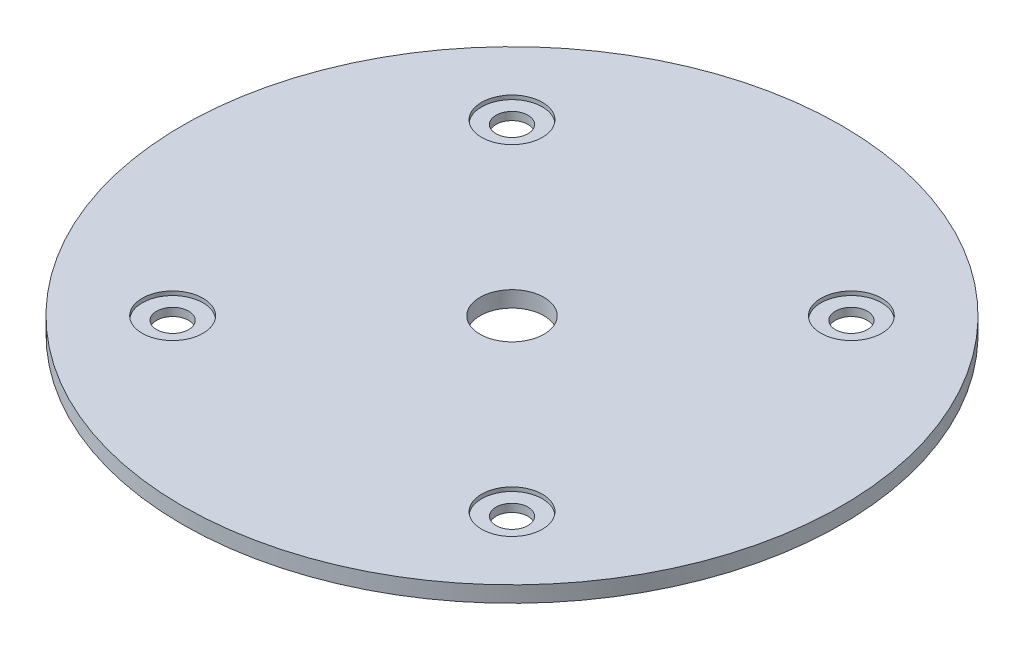
ISO-10303-21;
HEADER;
FILE_DESCRIPTION(('STEP AP214'),'2;1');
FILE_NAME('part.step','',(''),(''),'','','');
FILE_SCHEMA(('AUTOMOTIVE_DESIGN { 1 0 10303 214 1 1 1 1 }'));
ENDSEC;
DATA;
#1=APPLICATION_CONTEXT('core data for automotive mechanical design processes');
#2=APPLICATION_PROTOCOL_DEFINITION('international standard','automotive_design',2000,#1);
#3=PRODUCT_CONTEXT('',#1,'mechanical');
#4=PRODUCT('Part','Part','',(#3));
#5=PRODUCT_RELATED_PRODUCT_CATEGORY('part','',(#4));
#6=PRODUCT_DEFINITION_FORMATION('','',#4);
#7=PRODUCT_DEFINITION_CONTEXT('part definition',#1,'design');
#8=PRODUCT_DEFINITION('design','',#6,#7);
#9=PRODUCT_DEFINITION_SHAPE('','',#8);
#10=(LENGTH_UNIT() NAMED_UNIT(*) SI_UNIT(.MILLI.,.METRE.));
#11=(NAMED_UNIT(*) PLANE_ANGLE_UNIT() SI_UNIT($,.RADIAN.));
#12=(NAMED_UNIT(*) SI_UNIT($,.STERADIAN.) SOLID_ANGLE_UNIT());
#13=UNCERTAINTY_MEASURE_WITH_UNIT(LENGTH_MEASURE(1.E-05),#10,'distance_accuracy_value','');
#14=(GEOMETRIC_REPRESENTATION_CONTEXT(3) GLOBAL_UNCERTAINTY_ASSIGNED_CONTEXT((#13)) GLOBAL_UNIT_ASSIGNED_CONTEXT((#10,
#11,#12)) REPRESENTATION_CONTEXT('',''));
#15=CARTESIAN_POINT('',(0.,0.,0.));
#16=DIRECTION('',(0.,0.,1.));
#17=DIRECTION('',(1.,0.,0.));
#18=AXIS2_PLACEMENT_3D('',#15,#16,#17);
#19=CARTESIAN_POINT('',(-33.6759604540092,1.5875,33.6759604540094));
#20=DIRECTION('',(0.,1.,0.));
#21=DIRECTION('',(0.,0.,1.));
#22=AXIS2_PLACEMENT_3D('',#19,#20,#21);
#23=CYLINDRICAL_SURFACE('',#22,3.175);
#24=CARTESIAN_POINT('',(-33.6759604540092,0.79375,33.6759604540094));
#25=DIRECTION('',(0.,1.,0.));
#26=DIRECTION('',(0.,0.,1.));
#27=AXIS2_PLACEMENT_3D('',#24,#25,#26);
#28=CIRCLE('',#27,3.175);
#29=CARTESIAN_POINT('',(-33.6759604540092,0.79375,36.8509604540094));
#30=VERTEX_POINT('',#29);
#31=EDGE_CURVE('E65',#30,#30,#28,.F.);
#32=ORIENTED_EDGE('',*,*,#31,.F.);
#33=EDGE_LOOP('',(#32));
#34=FACE_BOUND('',#33,.T.);
#35=CARTESIAN_POINT('',(-33.6759604540092,-0.79375,33.6759604540094));
#36=DIRECTION('',(0.,-1.,0.));
#37=DIRECTION('',(0.,0.,-1.));
#38=AXIS2_PLACEMENT_3D('',#35,#36,#37);
#39=CIRCLE('',#38,3.175);
#40=CARTESIAN_POINT('',(-33.6759604540092,-0.79375,30.5009604540094));
#41=VERTEX_POINT('',#40);
#42=EDGE_CURVE('E41',#41,#41,#39,.F.);
#43=ORIENTED_EDGE('',*,*,#42,.F.);
#44=EDGE_LOOP('',(#43));
#45=FACE_BOUND('',#44,.T.);
#46=ADVANCED_FACE('F37',(#34,#45),#23,.F.);
#47=CARTESIAN_POINT('',(33.6759604540094,1.5875,33.6759604540092));
#48=DIRECTION('',(0.,1.,0.));
#49=DIRECTION('',(0.,0.,1.));
#50=AXIS2_PLACEMENT_3D('',#47,#48,#49);
#51=CYLINDRICAL_SURFACE('',#50,3.175);
#52=CARTESIAN_POINT('',(33.6759604540094,0.79375,33.6759604540092));
#53=DIRECTION('',(0.,1.,0.));
#54=DIRECTION('',(0.,0.,1.));
#55=AXIS2_PLACEMENT_3D('',#52,#53,#54);
#56=CIRCLE('',#55,3.175);
#57=CARTESIAN_POINT('',(33.6759604540094,0.79375,36.8509604540092));
#58=VERTEX_POINT('',#57);
#59=EDGE_CURVE('E62',#58,#58,#56,.F.);
#60=ORIENTED_EDGE('',*,*,#59,.F.);
#61=EDGE_LOOP('',(#60));
#62=FACE_BOUND('',#61,.T.);
#63=CARTESIAN_POINT('',(33.6759604540094,-0.79375,33.6759604540092));
#64=DIRECTION('',(0.,-1.,0.));
#65=DIRECTION('',(0.,0.,-1.));
#66=AXIS2_PLACEMENT_3D('',#63,#64,#65);
#67=CIRCLE('',#66,3.175);
#68=CARTESIAN_POINT('',(33.6759604540094,-0.79375,30.5009604540093));
#69=VERTEX_POINT('',#68);
#70=EDGE_CURVE('E75',#69,#69,#67,.F.);
#71=ORIENTED_EDGE('',*,*,#70,.F.);
#72=EDGE_LOOP('',(#71));
#73=FACE_BOUND('',#72,.T.);
#74=ADVANCED_FACE('F125',(#62,#73),#51,.F.);
#75=CARTESIAN_POINT('',(33.6759604540092,1.5875,-33.6759604540094));
#76=DIRECTION('',(0.,1.,0.));
#77=DIRECTION('',(0.,0.,1.));
#78=AXIS2_PLACEMENT_3D('',#75,#76,#77);
#79=CYLINDRICAL_SURFACE('',#78,3.175);
#80=CARTESIAN_POINT('',(33.6759604540092,0.79375,-33.6759604540094));
#81=DIRECTION('',(0.,1.,0.));
#82=DIRECTION('',(0.,0.,1.));
#83=AXIS2_PLACEMENT_3D('',#80,#81,#82);
#84=CIRCLE('',#83,3.175);
#85=CARTESIAN_POINT('',(33.6759604540092,0.79375,-30.5009604540094));
#86=VERTEX_POINT('',#85);
#87=EDGE_CURVE('E58',#86,#86,#84,.F.);
#88=ORIENTED_EDGE('',*,*,#87,.F.);
#89=EDGE_LOOP('',(#88));
#90=FACE_BOUND('',#89,.T.);
#91=CARTESIAN_POINT('',(33.6759604540092,-0.79375,-33.6759604540094));
#92=DIRECTION('',(0.,-1.,0.));
#93=DIRECTION('',(0.,0.,-1.));
#94=AXIS2_PLACEMENT_3D('',#91,#92,#93);
#95=CIRCLE('',#94,3.175);
#96=CARTESIAN_POINT('',(33.6759604540092,-0.79375,-36.8509604540094));
#97=VERTEX_POINT('',#96);
#98=EDGE_CURVE('E72',#97,#97,#95,.F.);
#99=ORIENTED_EDGE('',*,*,#98,.F.);
#100=EDGE_LOOP('',(#99));
#101=FACE_BOUND('',#100,.T.);
#102=ADVANCED_FACE('F132',(#90,#101),#79,.F.);
#103=CARTESIAN_POINT('',(-33.6759604540094,1.5875,-33.6759604540092));
#104=DIRECTION('',(0.,1.,0.));
#105=DIRECTION('',(0.,0.,1.));
#106=AXIS2_PLACEMENT_3D('',#103,#104,#105);
#107=CYLINDRICAL_SURFACE('',#106,3.175);
#108=CARTESIAN_POINT('',(-33.6759604540094,0.79375,-33.6759604540092));
#109=DIRECTION('',(0.,1.,0.));
#110=DIRECTION('',(0.,0.,1.));
#111=AXIS2_PLACEMENT_3D('',#108,#109,#110);
#112=CIRCLE('',#111,3.175);
#113=CARTESIAN_POINT('',(-33.6759604540094,0.79375,-30.5009604540093));
#114=VERTEX_POINT('',#113);
#115=EDGE_CURVE('E55',#114,#114,#112,.F.);
#116=ORIENTED_EDGE('',*,*,#115,.F.);
#117=EDGE_LOOP('',(#116));
#118=FACE_BOUND('',#117,.T.);
#119=CARTESIAN_POINT('',(-33.6759604540094,-0.79375,-33.6759604540092));
#120=DIRECTION('',(0.,-1.,0.));
#121=DIRECTION('',(0.,0.,-1.));
#122=AXIS2_PLACEMENT_3D('',#119,#120,#121);
#123=CIRCLE('',#122,3.175);
#124=CARTESIAN_POINT('',(-33.6759604540094,-0.79375,-36.8509604540092));
#125=VERTEX_POINT('',#124);
#126=EDGE_CURVE('E69',#125,#125,#123,.F.);
#127=ORIENTED_EDGE('',*,*,#126,.F.);
#128=EDGE_LOOP('',(#127));
#129=FACE_BOUND('',#128,.T.);
#130=ADVANCED_FACE('F142',(#118,#129),#107,.F.);
#131=CARTESIAN_POINT('',(0.,1.5875,0.));
#132=DIRECTION('',(0.,-1.,0.));
#133=DIRECTION('',(0.,0.,-1.));
#134=AXIS2_PLACEMENT_3D('',#131,#132,#133);
#135=CYLINDRICAL_SURFACE('',#134,65.405);
#136=CARTESIAN_POINT('',(0.,1.5875,0.));
#137=DIRECTION('',(0.,1.,0.));
#138=DIRECTION('',(0.,0.,1.));
#139=AXIS2_PLACEMENT_3D('',#136,#137,#138);
#140=CIRCLE('',#139,65.405);
#141=CARTESIAN_POINT('',(0.,1.5875,65.405));
#142=VERTEX_POINT('',#141);
#143=EDGE_CURVE('E10',#142,#142,#140,.T.);
#144=ORIENTED_EDGE('',*,*,#143,.F.);
#145=EDGE_LOOP('',(#144));
#146=FACE_BOUND('',#145,.T.);
#147=CARTESIAN_POINT('',(0.,-1.5875,0.));
#148=DIRECTION('',(0.,1.,0.));
#149=DIRECTION('',(0.,0.,1.));
#150=AXIS2_PLACEMENT_3D('',#147,#148,#149);
#151=CIRCLE('',#150,65.405);
#152=CARTESIAN_POINT('',(0.,-1.5875,65.405));
#153=VERTEX_POINT('',#152);
#154=EDGE_CURVE('E45',#153,#153,#151,.T.);
#155=ORIENTED_EDGE('',*,*,#154,.T.);
#156=EDGE_LOOP('',(#155));
#157=FACE_BOUND('',#156,.T.);
#158=ADVANCED_FACE('F39',(#146,#157),#135,.T.);
#159=CARTESIAN_POINT('',(0.,1.5875,0.));
#160=DIRECTION('',(0.,1.,0.));
#161=DIRECTION('',(0.,0.,1.));
#162=AXIS2_PLACEMENT_3D('',#159,#160,#161);
#163=PLANE('',#162);
#164=CARTESIAN_POINT('',(-33.6759604540092,1.5875,33.6759604540094));
#165=DIRECTION('',(0.,1.,0.));
#166=DIRECTION('',(0.,0.,1.));
#167=AXIS2_PLACEMENT_3D('',#164,#165,#166);
#168=CIRCLE('',#167,6.0325);
#169=CARTESIAN_POINT('',(-33.6759604540092,1.5875,39.7084604540094));
#170=VERTEX_POINT('',#169);
#171=EDGE_CURVE('E84',#170,#170,#168,.T.);
#172=ORIENTED_EDGE('',*,*,#171,.F.);
#173=EDGE_LOOP('',(#172));
#174=FACE_BOUND('',#173,.T.);
#175=CARTESIAN_POINT('',(33.6759604540094,1.5875,33.6759604540092));
#176=DIRECTION('',(0.,1.,0.));
#177=DIRECTION('',(0.,0.,1.));
#178=AXIS2_PLACEMENT_3D('',#175,#176,#177);
#179=CIRCLE('',#178,6.0325);
#180=CARTESIAN_POINT('',(33.6759604540094,1.5875,39.7084604540093));
#181=VERTEX_POINT('',#180);
#182=EDGE_CURVE('E149',#181,#181,#179,.T.);
#183=ORIENTED_EDGE('',*,*,#182,.F.);
#184=EDGE_LOOP('',(#183));
#185=FACE_BOUND('',#184,.T.);
#186=CARTESIAN_POINT('',(33.6759604540092,1.5875,-33.6759604540094));
#187=DIRECTION('',(0.,1.,0.));
#188=DIRECTION('',(0.,0.,1.));
#189=AXIS2_PLACEMENT_3D('',#186,#187,#188);
#190=CIRCLE('',#189,6.03249999999999);
#191=CARTESIAN_POINT('',(33.6759604540092,1.5875,-27.6434604540094));
#192=VERTEX_POINT('',#191);
#193=EDGE_CURVE('E97',#192,#192,#190,.T.);
#194=ORIENTED_EDGE('',*,*,#193,.F.);
#195=EDGE_LOOP('',(#194));
#196=FACE_BOUND('',#195,.T.);
#197=CARTESIAN_POINT('',(-33.6759604540094,1.5875,-33.6759604540092));
#198=DIRECTION('',(0.,1.,0.));
#199=DIRECTION('',(0.,0.,1.));
#200=AXIS2_PLACEMENT_3D('',#197,#198,#199);
#201=CIRCLE('',#200,6.0325);
#202=CARTESIAN_POINT('',(-33.6759604540094,1.5875,-27.6434604540092));
#203=VERTEX_POINT('',#202);
#204=EDGE_CURVE('E95',#203,#203,#201,.T.);
#205=ORIENTED_EDGE('',*,*,#204,.F.);
#206=EDGE_LOOP('',(#205));
#207=FACE_BOUND('',#206,.T.);
#208=CARTESIAN_POINT('',(0.,1.5875,0.));
#209=DIRECTION('',(0.,1.,0.));
#210=DIRECTION('',(0.,0.,1.));
#211=AXIS2_PLACEMENT_3D('',#208,#209,#210);
#212=CIRCLE('',#211,6.35);
#213=CARTESIAN_POINT('',(0.,1.5875,6.35));
#214=VERTEX_POINT('',#213);
#215=EDGE_CURVE('E68',#214,#214,#212,.T.);
#216=ORIENTED_EDGE('',*,*,#215,.F.);
#217=EDGE_LOOP('',(#216));
#218=FACE_BOUND('',#217,.T.);
#219=ORIENTED_EDGE('',*,*,#143,.T.);
#220=EDGE_LOOP('',(#219));
#221=FACE_BOUND('',#220,.T.);
#222=ADVANCED_FACE('F120',(#174,#185,#196,#207,#218,#221),#163,.T.);
#223=CARTESIAN_POINT('',(0.,-1.5875,0.));
#224=DIRECTION('',(0.,1.,0.));
#225=DIRECTION('',(0.,0.,1.));
#226=AXIS2_PLACEMENT_3D('',#223,#224,#225);
#227=PLANE('',#226);
#228=CARTESIAN_POINT('',(-33.6759604540092,-1.5875,33.6759604540094));
#229=DIRECTION('',(0.,1.,0.));
#230=DIRECTION('',(0.,0.,1.));
#231=AXIS2_PLACEMENT_3D('',#228,#229,#230);
#232=CIRCLE('',#231,6.0325);
#233=CARTESIAN_POINT('',(-33.6759604540092,-1.5875,39.7084604540094));
#234=VERTEX_POINT('',#233);
#235=EDGE_CURVE('E385',#234,#234,#232,.T.);
#236=ORIENTED_EDGE('',*,*,#235,.T.);
#237=EDGE_LOOP('',(#236));
#238=FACE_BOUND('',#237,.T.);
#239=CARTESIAN_POINT('',(33.6759604540094,-1.5875,33.6759604540092));
#240=DIRECTION('',(0.,1.,0.));
#241=DIRECTION('',(0.,0.,1.));
#242=AXIS2_PLACEMENT_3D('',#239,#240,#241);
#243=CIRCLE('',#242,6.0325);
#244=CARTESIAN_POINT('',(33.6759604540094,-1.5875,39.7084604540093));
#245=VERTEX_POINT('',#244);
#246=EDGE_CURVE('E379',#245,#245,#243,.T.);
#247=ORIENTED_EDGE('',*,*,#246,.T.);
#248=EDGE_LOOP('',(#247));
#249=FACE_BOUND('',#248,.T.);
#250=CARTESIAN_POINT('',(33.6759604540092,-1.5875,-33.6759604540094));
#251=DIRECTION('',(0.,1.,0.));
#252=DIRECTION('',(0.,0.,1.));
#253=AXIS2_PLACEMENT_3D('',#250,#251,#252);
#254=CIRCLE('',#253,6.03249999999999);
#255=CARTESIAN_POINT('',(33.6759604540092,-1.5875,-27.6434604540094));
#256=VERTEX_POINT('',#255);
#257=EDGE_CURVE('E369',#256,#256,#254,.T.);
#258=ORIENTED_EDGE('',*,*,#257,.T.);
#259=EDGE_LOOP('',(#258));
#260=FACE_BOUND('',#259,.T.);
#261=CARTESIAN_POINT('',(-33.6759604540094,-1.5875,-33.6759604540092));
#262=DIRECTION('',(0.,1.,0.));
#263=DIRECTION('',(0.,0.,1.));
#264=AXIS2_PLACEMENT_3D('',#261,#262,#263);
#265=CIRCLE('',#264,6.0325);
#266=CARTESIAN_POINT('',(-33.6759604540094,-1.5875,-27.6434604540092));
#267=VERTEX_POINT('',#266);
#268=EDGE_CURVE('E368',#267,#267,#265,.T.);
#269=ORIENTED_EDGE('',*,*,#268,.T.);
#270=EDGE_LOOP('',(#269));
#271=FACE_BOUND('',#270,.T.);
#272=CARTESIAN_POINT('',(0.,-1.5875,0.));
#273=DIRECTION('',(0.,1.,0.));
#274=DIRECTION('',(0.,0.,1.));
#275=AXIS2_PLACEMENT_3D('',#272,#273,#274);
#276=CIRCLE('',#275,6.35);
#277=CARTESIAN_POINT('',(0.,-1.5875,6.35));
#278=VERTEX_POINT('',#277);
#279=EDGE_CURVE('E50',#278,#278,#276,.T.);
#280=ORIENTED_EDGE('',*,*,#279,.T.);
#281=EDGE_LOOP('',(#280));
#282=FACE_BOUND('',#281,.T.);
#283=ORIENTED_EDGE('',*,*,#154,.F.);
#284=EDGE_LOOP('',(#283));
#285=FACE_BOUND('',#284,.T.);
#286=ADVANCED_FACE('F104',(#238,#249,#260,#271,#282,#285),#227,.F.);
#287=CARTESIAN_POINT('',(0.,1.5875,0.));
#288=DIRECTION('',(0.,1.,0.));
#289=DIRECTION('',(0.,0.,1.));
#290=AXIS2_PLACEMENT_3D('',#287,#288,#289);
#291=CYLINDRICAL_SURFACE('',#290,6.35);
#292=ORIENTED_EDGE('',*,*,#279,.F.);
#293=EDGE_LOOP('',(#292));
#294=FACE_BOUND('',#293,.T.);
#295=ORIENTED_EDGE('',*,*,#215,.T.);
#296=EDGE_LOOP('',(#295));
#297=FACE_BOUND('',#296,.T.);
#298=ADVANCED_FACE('F107',(#294,#297),#291,.F.);
#299=CARTESIAN_POINT('',(-33.6759604540094,0.79375,-33.6759604540092));
#300=DIRECTION('',(0.,1.,0.));
#301=DIRECTION('',(0.,0.,1.));
#302=AXIS2_PLACEMENT_3D('',#299,#300,#301);
#303=PLANE('',#302);
#304=CARTESIAN_POINT('',(-33.6759604540094,0.79375,-33.6759604540092));
#305=DIRECTION('',(0.,1.,0.));
#306=DIRECTION('',(0.,0.,1.));
#307=AXIS2_PLACEMENT_3D('',#304,#305,#306);
#308=CIRCLE('',#307,6.0325);
#309=CARTESIAN_POINT('',(-33.6759604540094,0.79375,-27.6434604540092));
#310=VERTEX_POINT('',#309);
#311=EDGE_CURVE('E59',#310,#310,#308,.T.);
#312=ORIENTED_EDGE('',*,*,#311,.T.);
#313=EDGE_LOOP('',(#312));
#314=FACE_BOUND('',#313,.T.);
#315=ORIENTED_EDGE('',*,*,#115,.T.);
#316=EDGE_LOOP('',(#315));
#317=FACE_BOUND('',#316,.T.);
#318=ADVANCED_FACE('F109',(#314,#317),#303,.T.);
#319=CARTESIAN_POINT('',(-33.6759604540094,0.79375,-33.6759604540092));
#320=DIRECTION('',(0.,1.,0.));
#321=DIRECTION('',(0.,0.,1.));
#322=AXIS2_PLACEMENT_3D('',#319,#320,#321);
#323=CYLINDRICAL_SURFACE('',#322,6.0325);
#324=ORIENTED_EDGE('',*,*,#311,.F.);
#325=EDGE_LOOP('',(#324));
#326=FACE_BOUND('',#325,.T.);
#327=ORIENTED_EDGE('',*,*,#204,.T.);
#328=EDGE_LOOP('',(#327));
#329=FACE_BOUND('',#328,.T.);
#330=ADVANCED_FACE('F116',(#326,#329),#323,.F.);
#331=CARTESIAN_POINT('',(33.6759604540092,0.79375,-33.6759604540094));
#332=DIRECTION('',(0.,1.,0.));
#333=DIRECTION('',(0.,0.,1.));
#334=AXIS2_PLACEMENT_3D('',#331,#332,#333);
#335=PLANE('',#334);
#336=CARTESIAN_POINT('',(33.6759604540092,0.79375,-33.6759604540094));
#337=DIRECTION('',(0.,1.,0.));
#338=DIRECTION('',(0.,0.,1.));
#339=AXIS2_PLACEMENT_3D('',#336,#337,#338);
#340=CIRCLE('',#339,6.03249999999999);
#341=CARTESIAN_POINT('',(33.6759604540092,0.79375,-27.6434604540094));
#342=VERTEX_POINT('',#341);
#343=EDGE_CURVE('E391',#342,#342,#340,.T.);
#344=ORIENTED_EDGE('',*,*,#343,.T.);
#345=EDGE_LOOP('',(#344));
#346=FACE_BOUND('',#345,.T.);
#347=ORIENTED_EDGE('',*,*,#87,.T.);
#348=EDGE_LOOP('',(#347));
#349=FACE_BOUND('',#348,.T.);
#350=ADVANCED_FACE('F157',(#346,#349),#335,.T.);
#351=CARTESIAN_POINT('',(33.6759604540092,0.79375,-33.6759604540094));
#352=DIRECTION('',(0.,1.,0.));
#353=DIRECTION('',(0.,0.,1.));
#354=AXIS2_PLACEMENT_3D('',#351,#352,#353);
#355=CYLINDRICAL_SURFACE('',#354,6.03249999999999);
#356=ORIENTED_EDGE('',*,*,#343,.F.);
#357=EDGE_LOOP('',(#356));
#358=FACE_BOUND('',#357,.T.);
#359=ORIENTED_EDGE('',*,*,#193,.T.);
#360=EDGE_LOOP('',(#359));
#361=FACE_BOUND('',#360,.T.);
#362=ADVANCED_FACE('F162',(#358,#361),#355,.F.);
#363=CARTESIAN_POINT('',(33.6759604540094,0.79375,33.6759604540092));
#364=DIRECTION('',(0.,1.,0.));
#365=DIRECTION('',(0.,0.,1.));
#366=AXIS2_PLACEMENT_3D('',#363,#364,#365);
#367=PLANE('',#366);
#368=CARTESIAN_POINT('',(33.6759604540094,0.79375,33.6759604540092));
#369=DIRECTION('',(0.,1.,0.));
#370=DIRECTION('',(0.,0.,1.));
#371=AXIS2_PLACEMENT_3D('',#368,#369,#370);
#372=CIRCLE('',#371,6.0325);
#373=CARTESIAN_POINT('',(33.6759604540094,0.79375,39.7084604540093));
#374=VERTEX_POINT('',#373);
#375=EDGE_CURVE('E89',#374,#374,#372,.T.);
#376=ORIENTED_EDGE('',*,*,#375,.T.);
#377=EDGE_LOOP('',(#376));
#378=FACE_BOUND('',#377,.T.);
#379=ORIENTED_EDGE('',*,*,#59,.T.);
#380=EDGE_LOOP('',(#379));
#381=FACE_BOUND('',#380,.T.);
#382=ADVANCED_FACE('F175',(#378,#381),#367,.T.);
#383=CARTESIAN_POINT('',(33.6759604540094,0.79375,33.6759604540092));
#384=DIRECTION('',(0.,1.,0.));
#385=DIRECTION('',(0.,0.,1.));
#386=AXIS2_PLACEMENT_3D('',#383,#384,#385);
#387=CYLINDRICAL_SURFACE('',#386,6.0325);
#388=ORIENTED_EDGE('',*,*,#375,.F.);
#389=EDGE_LOOP('',(#388));
#390=FACE_BOUND('',#389,.T.);
#391=ORIENTED_EDGE('',*,*,#182,.T.);
#392=EDGE_LOOP('',(#391));
#393=FACE_BOUND('',#392,.T.);
#394=ADVANCED_FACE('F171',(#390,#393),#387,.F.);
#395=CARTESIAN_POINT('',(-33.6759604540092,0.79375,33.6759604540094));
#396=DIRECTION('',(0.,1.,0.));
#397=DIRECTION('',(0.,0.,1.));
#398=AXIS2_PLACEMENT_3D('',#395,#396,#397);
#399=PLANE('',#398);
#400=CARTESIAN_POINT('',(-33.6759604540092,0.79375,33.6759604540094));
#401=DIRECTION('',(0.,1.,0.));
#402=DIRECTION('',(0.,0.,1.));
#403=AXIS2_PLACEMENT_3D('',#400,#401,#402);
#404=CIRCLE('',#403,6.0325);
#405=CARTESIAN_POINT('',(-33.6759604540092,0.79375,39.7084604540094));
#406=VERTEX_POINT('',#405);
#407=EDGE_CURVE('E80',#406,#406,#404,.T.);
#408=ORIENTED_EDGE('',*,*,#407,.T.);
#409=EDGE_LOOP('',(#408));
#410=FACE_BOUND('',#409,.T.);
#411=ORIENTED_EDGE('',*,*,#31,.T.);
#412=EDGE_LOOP('',(#411));
#413=FACE_BOUND('',#412,.T.);
#414=ADVANCED_FACE('F167',(#410,#413),#399,.T.);
#415=CARTESIAN_POINT('',(-33.6759604540092,0.79375,33.6759604540094));
#416=DIRECTION('',(0.,1.,0.));
#417=DIRECTION('',(0.,0.,1.));
#418=AXIS2_PLACEMENT_3D('',#415,#416,#417);
#419=CYLINDRICAL_SURFACE('',#418,6.0325);
#420=ORIENTED_EDGE('',*,*,#407,.F.);
#421=EDGE_LOOP('',(#420));
#422=FACE_BOUND('',#421,.T.);
#423=ORIENTED_EDGE('',*,*,#171,.T.);
#424=EDGE_LOOP('',(#423));
#425=FACE_BOUND('',#424,.T.);
#426=ADVANCED_FACE('F170',(#422,#425),#419,.F.);
#427=CARTESIAN_POINT('',(-33.6759604540094,-0.79375,-33.6759604540092));
#428=DIRECTION('',(0.,-1.,0.));
#429=DIRECTION('',(0.,0.,1.));
#430=AXIS2_PLACEMENT_3D('',#427,#428,#429);
#431=PLANE('',#430);
#432=CARTESIAN_POINT('',(-33.6759604540094,-0.79375,-33.6759604540092));
#433=DIRECTION('',(0.,1.,0.));
#434=DIRECTION('',(0.,0.,1.));
#435=AXIS2_PLACEMENT_3D('',#432,#433,#434);
#436=CIRCLE('',#435,6.0325);
#437=CARTESIAN_POINT('',(-33.6759604540094,-0.79375,-27.6434604540092));
#438=VERTEX_POINT('',#437);
#439=EDGE_CURVE('E73',#438,#438,#436,.T.);
#440=ORIENTED_EDGE('',*,*,#439,.F.);
#441=EDGE_LOOP('',(#440));
#442=FACE_BOUND('',#441,.T.);
#443=ORIENTED_EDGE('',*,*,#126,.T.);
#444=EDGE_LOOP('',(#443));
#445=FACE_BOUND('',#444,.T.);
#446=ADVANCED_FACE('F173',(#442,#445),#431,.T.);
#447=CARTESIAN_POINT('',(-33.6759604540094,-0.79375,-33.6759604540092));
#448=DIRECTION('',(0.,-1.,0.));
#449=DIRECTION('',(0.,0.,-1.));
#450=AXIS2_PLACEMENT_3D('',#447,#448,#449);
#451=CYLINDRICAL_SURFACE('',#450,6.0325);
#452=ORIENTED_EDGE('',*,*,#439,.T.);
#453=EDGE_LOOP('',(#452));
#454=FACE_BOUND('',#453,.T.);
#455=ORIENTED_EDGE('',*,*,#268,.F.);
#456=EDGE_LOOP('',(#455));
#457=FACE_BOUND('',#456,.T.);
#458=ADVANCED_FACE('F185',(#454,#457),#451,.F.);
#459=CARTESIAN_POINT('',(33.6759604540092,-0.79375,-33.6759604540094));
#460=DIRECTION('',(0.,-1.,0.));
#461=DIRECTION('',(0.,0.,1.));
#462=AXIS2_PLACEMENT_3D('',#459,#460,#461);
#463=PLANE('',#462);
#464=CARTESIAN_POINT('',(33.6759604540092,-0.79375,-33.6759604540094));
#465=DIRECTION('',(0.,1.,0.));
#466=DIRECTION('',(0.,0.,1.));
#467=AXIS2_PLACEMENT_3D('',#464,#465,#466);
#468=CIRCLE('',#467,6.03249999999999);
#469=CARTESIAN_POINT('',(33.6759604540092,-0.79375,-27.6434604540094));
#470=VERTEX_POINT('',#469);
#471=EDGE_CURVE('E220',#470,#470,#468,.T.);
#472=ORIENTED_EDGE('',*,*,#471,.F.);
#473=EDGE_LOOP('',(#472));
#474=FACE_BOUND('',#473,.T.);
#475=ORIENTED_EDGE('',*,*,#98,.T.);
#476=EDGE_LOOP('',(#475));
#477=FACE_BOUND('',#476,.T.);
#478=ADVANCED_FACE('F188',(#474,#477),#463,.T.);
#479=CARTESIAN_POINT('',(33.6759604540092,-0.79375,-33.6759604540094));
#480=DIRECTION('',(0.,-1.,0.));
#481=DIRECTION('',(0.,0.,-1.));
#482=AXIS2_PLACEMENT_3D('',#479,#480,#481);
#483=CYLINDRICAL_SURFACE('',#482,6.03249999999999);
#484=ORIENTED_EDGE('',*,*,#471,.T.);
#485=EDGE_LOOP('',(#484));
#486=FACE_BOUND('',#485,.T.);
#487=ORIENTED_EDGE('',*,*,#257,.F.);
#488=EDGE_LOOP('',(#487));
#489=FACE_BOUND('',#488,.T.);
#490=ADVANCED_FACE('F208',(#486,#489),#483,.F.);
#491=CARTESIAN_POINT('',(33.6759604540094,-0.79375,33.6759604540092));
#492=DIRECTION('',(0.,-1.,0.));
#493=DIRECTION('',(0.,0.,1.));
#494=AXIS2_PLACEMENT_3D('',#491,#492,#493);
#495=PLANE('',#494);
#496=CARTESIAN_POINT('',(33.6759604540094,-0.79375,33.6759604540092));
#497=DIRECTION('',(0.,1.,0.));
#498=DIRECTION('',(0.,0.,1.));
#499=AXIS2_PLACEMENT_3D('',#496,#497,#498);
#500=CIRCLE('',#499,6.0325);
#501=CARTESIAN_POINT('',(33.6759604540094,-0.79375,39.7084604540093));
#502=VERTEX_POINT('',#501);
#503=EDGE_CURVE('E374',#502,#502,#500,.T.);
#504=ORIENTED_EDGE('',*,*,#503,.F.);
#505=EDGE_LOOP('',(#504));
#506=FACE_BOUND('',#505,.T.);
#507=ORIENTED_EDGE('',*,*,#70,.T.);
#508=EDGE_LOOP('',(#507));
#509=FACE_BOUND('',#508,.T.);
#510=ADVANCED_FACE('F204',(#506,#509),#495,.T.);
#511=CARTESIAN_POINT('',(33.6759604540094,-0.79375,33.6759604540092));
#512=DIRECTION('',(0.,-1.,0.));
#513=DIRECTION('',(0.,0.,-1.));
#514=AXIS2_PLACEMENT_3D('',#511,#512,#513);
#515=CYLINDRICAL_SURFACE('',#514,6.0325);
#516=ORIENTED_EDGE('',*,*,#503,.T.);
#517=EDGE_LOOP('',(#516));
#518=FACE_BOUND('',#517,.T.);
#519=ORIENTED_EDGE('',*,*,#246,.F.);
#520=EDGE_LOOP('',(#519));
#521=FACE_BOUND('',#520,.T.);
#522=ADVANCED_FACE('F200',(#518,#521),#515,.F.);
#523=CARTESIAN_POINT('',(-33.6759604540092,-0.79375,33.6759604540094));
#524=DIRECTION('',(0.,-1.,0.));
#525=DIRECTION('',(0.,0.,1.));
#526=AXIS2_PLACEMENT_3D('',#523,#524,#525);
#527=PLANE('',#526);
#528=CARTESIAN_POINT('',(-33.6759604540092,-0.79375,33.6759604540094));
#529=DIRECTION('',(0.,1.,0.));
#530=DIRECTION('',(0.,0.,1.));
#531=AXIS2_PLACEMENT_3D('',#528,#529,#530);
#532=CIRCLE('',#531,6.0325);
#533=CARTESIAN_POINT('',(-33.6759604540092,-0.79375,39.7084604540094));
#534=VERTEX_POINT('',#533);
#535=EDGE_CURVE('E382',#534,#534,#532,.T.);
#536=ORIENTED_EDGE('',*,*,#535,.F.);
#537=EDGE_LOOP('',(#536));
#538=FACE_BOUND('',#537,.T.);
#539=ORIENTED_EDGE('',*,*,#42,.T.);
#540=EDGE_LOOP('',(#539));
#541=FACE_BOUND('',#540,.T.);
#542=ADVANCED_FACE('F196',(#538,#541),#527,.T.);
#543=CARTESIAN_POINT('',(-33.6759604540092,-0.79375,33.6759604540094));
#544=DIRECTION('',(0.,-1.,0.));
#545=DIRECTION('',(0.,0.,-1.));
#546=AXIS2_PLACEMENT_3D('',#543,#544,#545);
#547=CYLINDRICAL_SURFACE('',#546,6.0325);
#548=ORIENTED_EDGE('',*,*,#535,.T.);
#549=EDGE_LOOP('',(#548));
#550=FACE_BOUND('',#549,.T.);
#551=ORIENTED_EDGE('',*,*,#235,.F.);
#552=EDGE_LOOP('',(#551));
#553=FACE_BOUND('',#552,.T.);
#554=ADVANCED_FACE('F193',(#550,#553),#547,.F.);
#555=CLOSED_SHELL('',(#46,#74,#102,#130,#158,#222,#286,#298,#318,#330,#350,#362,#382,#394,#414,
#426,#446,#458,#478,#490,#510,#522,#542,#554));
#556=MANIFOLD_SOLID_BREP('B2',#555);
#557=ADVANCED_BREP_SHAPE_REPRESENTATION('',(#18,#556),#14);
#558=SHAPE_DEFINITION_REPRESENTATION(#9,#557);
ENDSEC;
END-ISO-10303-21;
